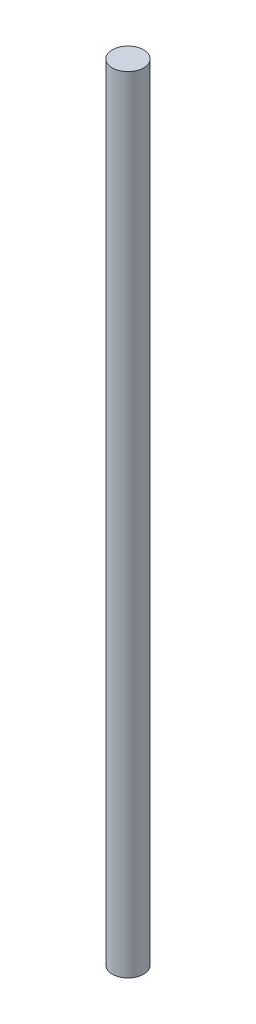
ISO-10303-21;
HEADER;
FILE_DESCRIPTION(('STEP AP214'),'2;1');
FILE_NAME('part.step','',(''),(''),'','','');
FILE_SCHEMA(('AUTOMOTIVE_DESIGN { 1 0 10303 214 1 1 1 1 }'));
ENDSEC;
DATA;
#1=APPLICATION_CONTEXT('core data for automotive mechanical design processes');
#2=APPLICATION_PROTOCOL_DEFINITION('international standard','automotive_design',2000,#1);
#3=PRODUCT_CONTEXT('',#1,'mechanical');
#4=PRODUCT('Part','Part','',(#3));
#5=PRODUCT_RELATED_PRODUCT_CATEGORY('part','',(#4));
#6=PRODUCT_DEFINITION_FORMATION('','',#4);
#7=PRODUCT_DEFINITION_CONTEXT('part definition',#1,'design');
#8=PRODUCT_DEFINITION('design','',#6,#7);
#9=PRODUCT_DEFINITION_SHAPE('','',#8);
#10=(LENGTH_UNIT() NAMED_UNIT(*) SI_UNIT(.MILLI.,.METRE.));
#11=(NAMED_UNIT(*) PLANE_ANGLE_UNIT() SI_UNIT($,.RADIAN.));
#12=(NAMED_UNIT(*) SI_UNIT($,.STERADIAN.) SOLID_ANGLE_UNIT());
#13=UNCERTAINTY_MEASURE_WITH_UNIT(LENGTH_MEASURE(1.E-05),#10,'distance_accuracy_value','');
#14=(GEOMETRIC_REPRESENTATION_CONTEXT(3) GLOBAL_UNCERTAINTY_ASSIGNED_CONTEXT((#13)) GLOBAL_UNIT_ASSIGNED_CONTEXT((#10,
#11,#12)) REPRESENTATION_CONTEXT('',''));
#15=CARTESIAN_POINT('',(0.,0.,0.));
#16=DIRECTION('',(0.,0.,1.));
#17=DIRECTION('',(1.,0.,0.));
#18=AXIS2_PLACEMENT_3D('',#15,#16,#17);
#19=CARTESIAN_POINT('',(0.,200.,0.));
#20=DIRECTION('',(0.,-1.,0.));
#21=DIRECTION('',(0.,0.,-1.));
#22=AXIS2_PLACEMENT_3D('',#19,#20,#21);
#23=CYLINDRICAL_SURFACE('',#22,4.);
#24=CARTESIAN_POINT('',(0.,200.,0.));
#25=DIRECTION('',(0.,1.,0.));
#26=DIRECTION('',(0.,0.,1.));
#27=AXIS2_PLACEMENT_3D('',#24,#25,#26);
#28=CIRCLE('',#27,4.);
#29=CARTESIAN_POINT('',(0.,200.,4.));
#30=VERTEX_POINT('',#29);
#31=EDGE_CURVE('E10',#30,#30,#28,.T.);
#32=ORIENTED_EDGE('',*,*,#31,.F.);
#33=EDGE_LOOP('',(#32));
#34=FACE_BOUND('',#33,.T.);
#35=CARTESIAN_POINT('',(0.,0.,0.));
#36=DIRECTION('',(0.,1.,0.));
#37=DIRECTION('',(0.,0.,1.));
#38=AXIS2_PLACEMENT_3D('',#35,#36,#37);
#39=CIRCLE('',#38,4.);
#40=CARTESIAN_POINT('',(0.,0.,4.));
#41=VERTEX_POINT('',#40);
#42=EDGE_CURVE('E46',#41,#41,#39,.T.);
#43=ORIENTED_EDGE('',*,*,#42,.T.);
#44=EDGE_LOOP('',(#43));
#45=FACE_BOUND('',#44,.T.);
#46=ADVANCED_FACE('F43',(#34,#45),#23,.T.);
#47=CARTESIAN_POINT('',(0.,200.,0.));
#48=DIRECTION('',(0.,1.,0.));
#49=DIRECTION('',(0.,0.,1.));
#50=AXIS2_PLACEMENT_3D('',#47,#48,#49);
#51=PLANE('',#50);
#52=ORIENTED_EDGE('',*,*,#31,.T.);
#53=EDGE_LOOP('',(#52));
#54=FACE_BOUND('',#53,.T.);
#55=ADVANCED_FACE('F58',(#54),#51,.T.);
#56=CARTESIAN_POINT('',(0.,0.,0.));
#57=DIRECTION('',(0.,1.,0.));
#58=DIRECTION('',(0.,0.,1.));
#59=AXIS2_PLACEMENT_3D('',#56,#57,#58);
#60=PLANE('',#59);
#61=ORIENTED_EDGE('',*,*,#42,.F.);
#62=EDGE_LOOP('',(#61));
#63=FACE_BOUND('',#62,.T.);
#64=ADVANCED_FACE('F56',(#63),#60,.F.);
#65=CLOSED_SHELL('',(#46,#55,#64));
#66=MANIFOLD_SOLID_BREP('B2',#65);
#67=ADVANCED_BREP_SHAPE_REPRESENTATION('',(#18,#66),#14);
#68=SHAPE_DEFINITION_REPRESENTATION(#9,#67);
ENDSEC;
END-ISO-10303-21;
